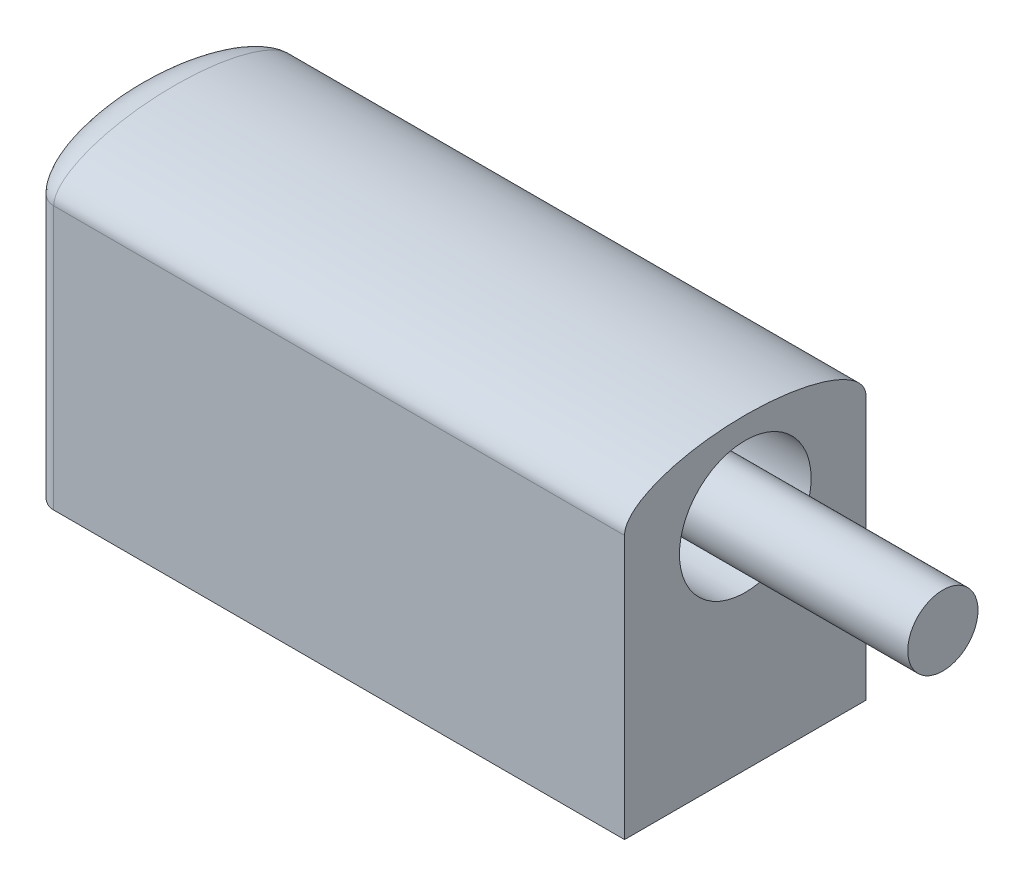
ISO-10303-21;
HEADER;
FILE_DESCRIPTION(('STEP AP214'),'2;1');
FILE_NAME('part.step','',(''),(''),'','','');
FILE_SCHEMA(('AUTOMOTIVE_DESIGN { 1 0 10303 214 1 1 1 1 }'));
ENDSEC;
DATA;
#1=APPLICATION_CONTEXT('core data for automotive mechanical design processes');
#2=APPLICATION_PROTOCOL_DEFINITION('international standard','automotive_design',2000,#1);
#3=PRODUCT_CONTEXT('',#1,'mechanical');
#4=PRODUCT('Part','Part','',(#3));
#5=PRODUCT_RELATED_PRODUCT_CATEGORY('part','',(#4));
#6=PRODUCT_DEFINITION_FORMATION('','',#4);
#7=PRODUCT_DEFINITION_CONTEXT('part definition',#1,'design');
#8=PRODUCT_DEFINITION('design','',#6,#7);
#9=PRODUCT_DEFINITION_SHAPE('','',#8);
#10=(LENGTH_UNIT() NAMED_UNIT(*) SI_UNIT(.MILLI.,.METRE.));
#11=(NAMED_UNIT(*) PLANE_ANGLE_UNIT() SI_UNIT($,.RADIAN.));
#12=(NAMED_UNIT(*) SI_UNIT($,.STERADIAN.) SOLID_ANGLE_UNIT());
#13=UNCERTAINTY_MEASURE_WITH_UNIT(LENGTH_MEASURE(1.E-05),#10,'distance_accuracy_value','');
#14=(GEOMETRIC_REPRESENTATION_CONTEXT(3) GLOBAL_UNCERTAINTY_ASSIGNED_CONTEXT((#13)) GLOBAL_UNIT_ASSIGNED_CONTEXT((#10,
#11,#12)) REPRESENTATION_CONTEXT('',''));
#15=CARTESIAN_POINT('',(0.,0.,0.));
#16=DIRECTION('',(0.,0.,1.));
#17=DIRECTION('',(1.,0.,0.));
#18=AXIS2_PLACEMENT_3D('',#15,#16,#17);
#19=CARTESIAN_POINT('',(-14.4848777348777,-2.36054421768707,11.));
#20=DIRECTION('',(0.,1.,0.));
#21=DIRECTION('',(0.,0.,1.));
#22=AXIS2_PLACEMENT_3D('',#19,#20,#21);
#23=PLANE('',#22);
#24=CARTESIAN_POINT('',(1.51512226512227,-2.36054421768707,5.5));
#25=DIRECTION('',(0.,-1.,0.));
#26=DIRECTION('',(0.,0.,-1.));
#27=AXIS2_PLACEMENT_3D('',#24,#25,#26);
#28=CIRCLE('',#27,2.1);
#29=CARTESIAN_POINT('',(1.51512226512227,-2.36054421768707,3.4));
#30=VERTEX_POINT('',#29);
#31=EDGE_CURVE('E190',#30,#30,#28,.T.);
#32=ORIENTED_EDGE('',*,*,#31,.F.);
#33=EDGE_LOOP('',(#32));
#34=FACE_BOUND('',#33,.T.);
#35=CARTESIAN_POINT('',(-6.48487773487773,-2.36054421768707,5.5));
#36=DIRECTION('',(0.,-1.,0.));
#37=DIRECTION('',(0.,0.,-1.));
#38=AXIS2_PLACEMENT_3D('',#35,#36,#37);
#39=CIRCLE('',#38,2.1);
#40=CARTESIAN_POINT('',(-6.48487773487773,-2.36054421768707,3.4));
#41=VERTEX_POINT('',#40);
#42=EDGE_CURVE('E182',#41,#41,#39,.T.);
#43=ORIENTED_EDGE('',*,*,#42,.F.);
#44=EDGE_LOOP('',(#43));
#45=FACE_BOUND('',#44,.T.);
#46=DIRECTION('',(1.,0.,0.));
#47=VECTOR('',#46,1.);
#48=CARTESIAN_POINT('',(-14.4848777348777,-2.36054421768707,11.));
#49=LINE('',#48,#47);
#50=CARTESIAN_POINT('',(-14.4848777348777,-2.36054421768707,11.));
#51=VERTEX_POINT('',#50);
#52=CARTESIAN_POINT('',(11.5151222651223,-2.36054421768707,11.));
#53=VERTEX_POINT('',#52);
#54=EDGE_CURVE('E84',#51,#53,#49,.T.);
#55=ORIENTED_EDGE('',*,*,#54,.F.);
#56=CARTESIAN_POINT('',(-14.4848777348777,-2.36054421768707,5.5));
#57=DIRECTION('',(0.,-1.,0.));
#58=DIRECTION('',(0.,0.,-1.));
#59=AXIS2_PLACEMENT_3D('',#56,#57,#58);
#60=ELLIPSE('',#59,5.5,2.);
#61=CARTESIAN_POINT('',(-14.4848777348777,-2.36054421768707,0.));
#62=VERTEX_POINT('',#61);
#63=EDGE_CURVE('E87',#51,#62,#60,.T.);
#64=ORIENTED_EDGE('',*,*,#63,.T.);
#65=DIRECTION('',(1.,0.,0.));
#66=VECTOR('',#65,1.);
#67=CARTESIAN_POINT('',(-14.4848777348777,-2.36054421768707,0.));
#68=LINE('',#67,#66);
#69=CARTESIAN_POINT('',(11.5151222651223,-2.36054421768707,0.));
#70=VERTEX_POINT('',#69);
#71=EDGE_CURVE('E70',#62,#70,#68,.T.);
#72=ORIENTED_EDGE('',*,*,#71,.T.);
#73=DIRECTION('',(0.,0.,-1.));
#74=VECTOR('',#73,1.);
#75=CARTESIAN_POINT('',(11.5151222651223,-2.36054421768707,11.));
#76=LINE('',#75,#74);
#77=EDGE_CURVE('E11',#53,#70,#76,.T.);
#78=ORIENTED_EDGE('',*,*,#77,.F.);
#79=EDGE_LOOP('',(#55,#64,#72,#78));
#80=FACE_BOUND('',#79,.T.);
#81=ADVANCED_FACE('F41',(#34,#45,#80),#23,.F.);
#82=CARTESIAN_POINT('',(11.5151222651223,-2.36054421768707,11.));
#83=DIRECTION('',(-1.,0.,0.));
#84=DIRECTION('',(0.,0.,1.));
#85=AXIS2_PLACEMENT_3D('',#82,#83,#84);
#86=PLANE('',#85);
#87=CARTESIAN_POINT('',(11.5151222651223,7.63945578231293,5.50000000000002));
#88=DIRECTION('',(1.,0.,0.));
#89=DIRECTION('',(0.,0.,-1.));
#90=AXIS2_PLACEMENT_3D('',#87,#88,#89);
#91=CIRCLE('',#90,3.);
#92=CARTESIAN_POINT('',(11.5151222651223,7.63945578231293,2.50000000000002));
#93=VERTEX_POINT('',#92);
#94=EDGE_CURVE('E110',#93,#93,#91,.T.);
#95=ORIENTED_EDGE('',*,*,#94,.F.);
#96=EDGE_LOOP('',(#95));
#97=FACE_BOUND('',#96,.T.);
#98=DIRECTION('',(0.,1.,0.));
#99=VECTOR('',#98,1.);
#100=CARTESIAN_POINT('',(11.5151222651223,-2.36054421768707,0.));
#101=LINE('',#100,#99);
#102=CARTESIAN_POINT('',(11.5151222651223,9.63945578231293,0.));
#103=VERTEX_POINT('',#102);
#104=EDGE_CURVE('E142',#70,#103,#101,.T.);
#105=ORIENTED_EDGE('',*,*,#104,.T.);
#106=CARTESIAN_POINT('',(11.5151222651223,9.63945578231293,5.5));
#107=DIRECTION('',(1.,0.,0.));
#108=DIRECTION('',(0.,0.,-1.));
#109=AXIS2_PLACEMENT_3D('',#106,#107,#108);
#110=ELLIPSE('',#109,5.5,2.);
#111=CARTESIAN_POINT('',(11.5151222651223,9.63945578231293,11.));
#112=VERTEX_POINT('',#111);
#113=EDGE_CURVE('E107',#103,#112,#110,.T.);
#114=ORIENTED_EDGE('',*,*,#113,.T.);
#115=DIRECTION('',(0.,1.,0.));
#116=VECTOR('',#115,1.);
#117=CARTESIAN_POINT('',(11.5151222651223,-2.36054421768707,11.));
#118=LINE('',#117,#116);
#119=EDGE_CURVE('E58',#53,#112,#118,.T.);
#120=ORIENTED_EDGE('',*,*,#119,.F.);
#121=ORIENTED_EDGE('',*,*,#77,.T.);
#122=EDGE_LOOP('',(#105,#114,#120,#121));
#123=FACE_BOUND('',#122,.T.);
#124=ADVANCED_FACE('F128',(#97,#123),#86,.F.);
#125=CARTESIAN_POINT('',(0.,0.,11.));
#126=DIRECTION('',(0.,0.,1.));
#127=DIRECTION('',(1.,0.,0.));
#128=AXIS2_PLACEMENT_3D('',#125,#126,#127);
#129=PLANE('',#128);
#130=DIRECTION('',(0.,-1.,0.));
#131=VECTOR('',#130,1.);
#132=CARTESIAN_POINT('',(-14.4848777348777,9.63945578231293,11.));
#133=LINE('',#132,#131);
#134=CARTESIAN_POINT('',(-14.4848777348777,9.63945578231293,10.9999999999999));
#135=VERTEX_POINT('',#134);
#136=EDGE_CURVE('E89',#135,#51,#133,.T.);
#137=ORIENTED_EDGE('',*,*,#136,.T.);
#138=ORIENTED_EDGE('',*,*,#54,.T.);
#139=ORIENTED_EDGE('',*,*,#119,.T.);
#140=DIRECTION('',(-1.,0.,0.));
#141=VECTOR('',#140,1.);
#142=CARTESIAN_POINT('',(-14.4848777348777,9.63945578231293,11.));
#143=LINE('',#142,#141);
#144=EDGE_CURVE('E50',#112,#135,#143,.T.);
#145=ORIENTED_EDGE('',*,*,#144,.T.);
#146=EDGE_LOOP('',(#137,#138,#139,#145));
#147=FACE_BOUND('',#146,.T.);
#148=ADVANCED_FACE('F92',(#147),#129,.T.);
#149=CARTESIAN_POINT('',(0.,0.,0.));
#150=DIRECTION('',(0.,0.,1.));
#151=DIRECTION('',(1.,0.,0.));
#152=AXIS2_PLACEMENT_3D('',#149,#150,#151);
#153=PLANE('',#152);
#154=DIRECTION('',(0.,-1.,0.));
#155=VECTOR('',#154,1.);
#156=CARTESIAN_POINT('',(-14.4848777348777,9.63945578231293,0.));
#157=LINE('',#156,#155);
#158=CARTESIAN_POINT('',(-14.4848777348777,9.63945578231293,0.));
#159=VERTEX_POINT('',#158);
#160=EDGE_CURVE('E100',#159,#62,#157,.T.);
#161=ORIENTED_EDGE('',*,*,#160,.F.);
#162=DIRECTION('',(-1.,0.,0.));
#163=VECTOR('',#162,1.);
#164=CARTESIAN_POINT('',(-14.4848777348777,9.63945578231293,0.));
#165=LINE('',#164,#163);
#166=EDGE_CURVE('E96',#103,#159,#165,.T.);
#167=ORIENTED_EDGE('',*,*,#166,.F.);
#168=ORIENTED_EDGE('',*,*,#104,.F.);
#169=ORIENTED_EDGE('',*,*,#71,.F.);
#170=EDGE_LOOP('',(#161,#167,#168,#169));
#171=FACE_BOUND('',#170,.T.);
#172=ADVANCED_FACE('F123',(#171),#153,.F.);
#173=CARTESIAN_POINT('',(-14.4848777348777,9.63945578231293,5.5));
#174=DIRECTION('',(1.,0.,0.));
#175=DIRECTION('',(0.,0.,-1.));
#176=AXIS2_PLACEMENT_3D('',#173,#174,#175);
#177=ELLIPSE('',#176,5.5,2.);
#178=DIRECTION('',(1.,0.,0.));
#179=VECTOR('',#178,1.);
#180=SURFACE_OF_LINEAR_EXTRUSION('',#177,#179);
#181=EDGE_CURVE('E78',#159,#135,#177,.T.);
#182=ORIENTED_EDGE('',*,*,#181,.T.);
#183=ORIENTED_EDGE('',*,*,#144,.F.);
#184=ORIENTED_EDGE('',*,*,#113,.F.);
#185=ORIENTED_EDGE('',*,*,#166,.T.);
#186=EDGE_LOOP('',(#182,#183,#184,#185));
#187=FACE_BOUND('',#186,.T.);
#188=ADVANCED_FACE('F119',(#187),#180,.T.);
#189=CARTESIAN_POINT('',(-14.4848777348777,9.63945578231293,5.5));
#190=DIRECTION('',(0.,-1.,0.));
#191=DIRECTION('',(0.,0.,-1.));
#192=AXIS2_PLACEMENT_3D('',#189,#190,#191);
#193=ELLIPSE('',#192,5.5,2.);
#194=DIRECTION('',(0.,-1.,0.));
#195=VECTOR('',#194,1.);
#196=SURFACE_OF_LINEAR_EXTRUSION('',#193,#195);
#197=ORIENTED_EDGE('',*,*,#136,.F.);
#198=EDGE_CURVE('E102',#135,#159,#193,.T.);
#199=ORIENTED_EDGE('',*,*,#198,.T.);
#200=ORIENTED_EDGE('',*,*,#160,.T.);
#201=ORIENTED_EDGE('',*,*,#63,.F.);
#202=EDGE_LOOP('',(#197,#199,#200,#201));
#203=FACE_BOUND('',#202,.T.);
#204=ADVANCED_FACE('F99',(#203),#196,.T.);
#205=CARTESIAN_POINT('',(-14.4848777348777,9.63945578231293,5.49999999999994));
#206=DIRECTION('',(0.,-1.,0.));
#207=DIRECTION('',(0.,0.,-1.));
#208=AXIS2_PLACEMENT_3D('',#205,#206,#207);
#209=ELLIPSE('',#208,5.49999999999994,2.);
#210=TRIMMED_CURVE('',#209,(PARAMETER_VALUE(3.14159265358979)),
(PARAMETER_VALUE(6.28318530717959)),.T.,.PARAMETER.);
#211=CARTESIAN_POINT('',(-14.4848777348777,9.63945578231293,0.));
#212=DIRECTION('',(0.,0.,-1.));
#213=AXIS1_PLACEMENT('',#211,#212);
#214=SURFACE_OF_REVOLUTION('',#210,#213);
#215=ORIENTED_EDGE('',*,*,#181,.F.);
#216=ORIENTED_EDGE('',*,*,#198,.F.);
#217=EDGE_LOOP('',(#215,#216));
#218=FACE_BOUND('',#217,.T.);
#219=ADVANCED_FACE('F158',(#218),#214,.T.);
#220=CARTESIAN_POINT('',(6.51512226512227,7.63945578231293,5.50000000000002));
#221=DIRECTION('',(1.,0.,0.));
#222=DIRECTION('',(0.,0.,-1.));
#223=AXIS2_PLACEMENT_3D('',#220,#221,#222);
#224=CYLINDRICAL_SURFACE('',#223,3.);
#225=CARTESIAN_POINT('',(6.51512226512227,7.63945578231293,5.50000000000002));
#226=DIRECTION('',(1.,0.,0.));
#227=DIRECTION('',(0.,0.,-1.));
#228=AXIS2_PLACEMENT_3D('',#225,#226,#227);
#229=CIRCLE('',#228,3.);
#230=CARTESIAN_POINT('',(6.51512226512227,7.63945578231293,2.50000000000002));
#231=VERTEX_POINT('',#230);
#232=EDGE_CURVE('E103',#231,#231,#229,.T.);
#233=ORIENTED_EDGE('',*,*,#232,.F.);
#234=EDGE_LOOP('',(#233));
#235=FACE_BOUND('',#234,.T.);
#236=ORIENTED_EDGE('',*,*,#94,.T.);
#237=EDGE_LOOP('',(#236));
#238=FACE_BOUND('',#237,.T.);
#239=ADVANCED_FACE('F160',(#235,#238),#224,.F.);
#240=CARTESIAN_POINT('',(6.51512226512227,7.63945578231293,5.50000000000002));
#241=DIRECTION('',(1.,0.,0.));
#242=DIRECTION('',(0.,0.,-1.));
#243=AXIS2_PLACEMENT_3D('',#240,#241,#242);
#244=PLANE('',#243);
#245=CARTESIAN_POINT('',(6.51512226512227,7.63945578231293,5.50000000000002));
#246=DIRECTION('',(1.,0.,0.));
#247=DIRECTION('',(0.,0.,-1.));
#248=AXIS2_PLACEMENT_3D('',#245,#246,#247);
#249=CIRCLE('',#248,1.6);
#250=CARTESIAN_POINT('',(6.51512226512227,7.63945578231293,3.90000000000002));
#251=VERTEX_POINT('',#250);
#252=EDGE_CURVE('E174',#251,#251,#249,.T.);
#253=ORIENTED_EDGE('',*,*,#252,.F.);
#254=EDGE_LOOP('',(#253));
#255=FACE_BOUND('',#254,.T.);
#256=ORIENTED_EDGE('',*,*,#232,.T.);
#257=EDGE_LOOP('',(#256));
#258=FACE_BOUND('',#257,.T.);
#259=ADVANCED_FACE('F165',(#255,#258),#244,.T.);
#260=CARTESIAN_POINT('',(20.5151222651223,7.63945578231293,5.50000000000002));
#261=DIRECTION('',(-1.,0.,0.));
#262=DIRECTION('',(0.,0.,1.));
#263=AXIS2_PLACEMENT_3D('',#260,#261,#262);
#264=CYLINDRICAL_SURFACE('',#263,1.6);
#265=CARTESIAN_POINT('',(20.5151222651223,7.63945578231293,5.50000000000002));
#266=DIRECTION('',(1.,0.,0.));
#267=DIRECTION('',(0.,0.,-1.));
#268=AXIS2_PLACEMENT_3D('',#265,#266,#267);
#269=CIRCLE('',#268,1.6);
#270=CARTESIAN_POINT('',(20.5151222651223,7.63945578231293,3.90000000000002));
#271=VERTEX_POINT('',#270);
#272=EDGE_CURVE('E172',#271,#271,#269,.T.);
#273=ORIENTED_EDGE('',*,*,#272,.F.);
#274=EDGE_LOOP('',(#273));
#275=FACE_BOUND('',#274,.T.);
#276=ORIENTED_EDGE('',*,*,#252,.T.);
#277=EDGE_LOOP('',(#276));
#278=FACE_BOUND('',#277,.T.);
#279=ADVANCED_FACE('F220',(#275,#278),#264,.T.);
#280=CARTESIAN_POINT('',(20.5151222651223,7.63945578231293,5.50000000000002));
#281=DIRECTION('',(1.,0.,0.));
#282=DIRECTION('',(0.,0.,-1.));
#283=AXIS2_PLACEMENT_3D('',#280,#281,#282);
#284=PLANE('',#283);
#285=ORIENTED_EDGE('',*,*,#272,.T.);
#286=EDGE_LOOP('',(#285));
#287=FACE_BOUND('',#286,.T.);
#288=ADVANCED_FACE('F211',(#287),#284,.T.);
#289=CARTESIAN_POINT('',(-6.48487773487773,3.63945578231293,5.5));
#290=DIRECTION('',(0.,-1.,0.));
#291=DIRECTION('',(0.,0.,-1.));
#292=AXIS2_PLACEMENT_3D('',#289,#290,#291);
#293=CYLINDRICAL_SURFACE('',#292,2.1);
#294=CARTESIAN_POINT('',(-6.48487773487773,3.63945578231293,5.5));
#295=DIRECTION('',(0.,-1.,0.));
#296=DIRECTION('',(0.,0.,-1.));
#297=AXIS2_PLACEMENT_3D('',#294,#295,#296);
#298=CIRCLE('',#297,2.1);
#299=CARTESIAN_POINT('',(-6.48487773487773,3.63945578231293,3.4));
#300=VERTEX_POINT('',#299);
#301=EDGE_CURVE('E186',#300,#300,#298,.T.);
#302=ORIENTED_EDGE('',*,*,#301,.F.);
#303=EDGE_LOOP('',(#302));
#304=FACE_BOUND('',#303,.T.);
#305=ORIENTED_EDGE('',*,*,#42,.T.);
#306=EDGE_LOOP('',(#305));
#307=FACE_BOUND('',#306,.T.);
#308=ADVANCED_FACE('F209',(#304,#307),#293,.F.);
#309=CARTESIAN_POINT('',(-6.48487773487773,3.63945578231293,5.5));
#310=DIRECTION('',(0.,-1.,0.));
#311=DIRECTION('',(0.,0.,-1.));
#312=AXIS2_PLACEMENT_3D('',#309,#310,#311);
#313=PLANE('',#312);
#314=ORIENTED_EDGE('',*,*,#301,.T.);
#315=EDGE_LOOP('',(#314));
#316=FACE_BOUND('',#315,.T.);
#317=ADVANCED_FACE('F203',(#316),#313,.T.);
#318=CARTESIAN_POINT('',(1.51512226512227,3.63945578231293,5.5));
#319=DIRECTION('',(0.,-1.,0.));
#320=DIRECTION('',(0.,0.,-1.));
#321=AXIS2_PLACEMENT_3D('',#318,#319,#320);
#322=CYLINDRICAL_SURFACE('',#321,2.1);
#323=CARTESIAN_POINT('',(1.51512226512227,3.63945578231293,5.5));
#324=DIRECTION('',(0.,-1.,0.));
#325=DIRECTION('',(0.,0.,-1.));
#326=AXIS2_PLACEMENT_3D('',#323,#324,#325);
#327=CIRCLE('',#326,2.1);
#328=CARTESIAN_POINT('',(1.51512226512227,3.63945578231293,3.4));
#329=VERTEX_POINT('',#328);
#330=EDGE_CURVE('E178',#329,#329,#327,.T.);
#331=ORIENTED_EDGE('',*,*,#330,.F.);
#332=EDGE_LOOP('',(#331));
#333=FACE_BOUND('',#332,.T.);
#334=ORIENTED_EDGE('',*,*,#31,.T.);
#335=EDGE_LOOP('',(#334));
#336=FACE_BOUND('',#335,.T.);
#337=ADVANCED_FACE('F200',(#333,#336),#322,.F.);
#338=CARTESIAN_POINT('',(1.51512226512227,3.63945578231293,5.5));
#339=DIRECTION('',(0.,-1.,0.));
#340=DIRECTION('',(0.,0.,-1.));
#341=AXIS2_PLACEMENT_3D('',#338,#339,#340);
#342=PLANE('',#341);
#343=ORIENTED_EDGE('',*,*,#330,.T.);
#344=EDGE_LOOP('',(#343));
#345=FACE_BOUND('',#344,.T.);
#346=ADVANCED_FACE('F198',(#345),#342,.T.);
#347=CLOSED_SHELL('',(#81,#124,#148,#172,#188,#204,#219,#239,#259,#279,#288,#308,#317,#337,#346));
#348=MANIFOLD_SOLID_BREP('B2',#347);
#349=ADVANCED_BREP_SHAPE_REPRESENTATION('',(#18,#348),#14);
#350=SHAPE_DEFINITION_REPRESENTATION(#9,#349);
ENDSEC;
END-ISO-10303-21;
